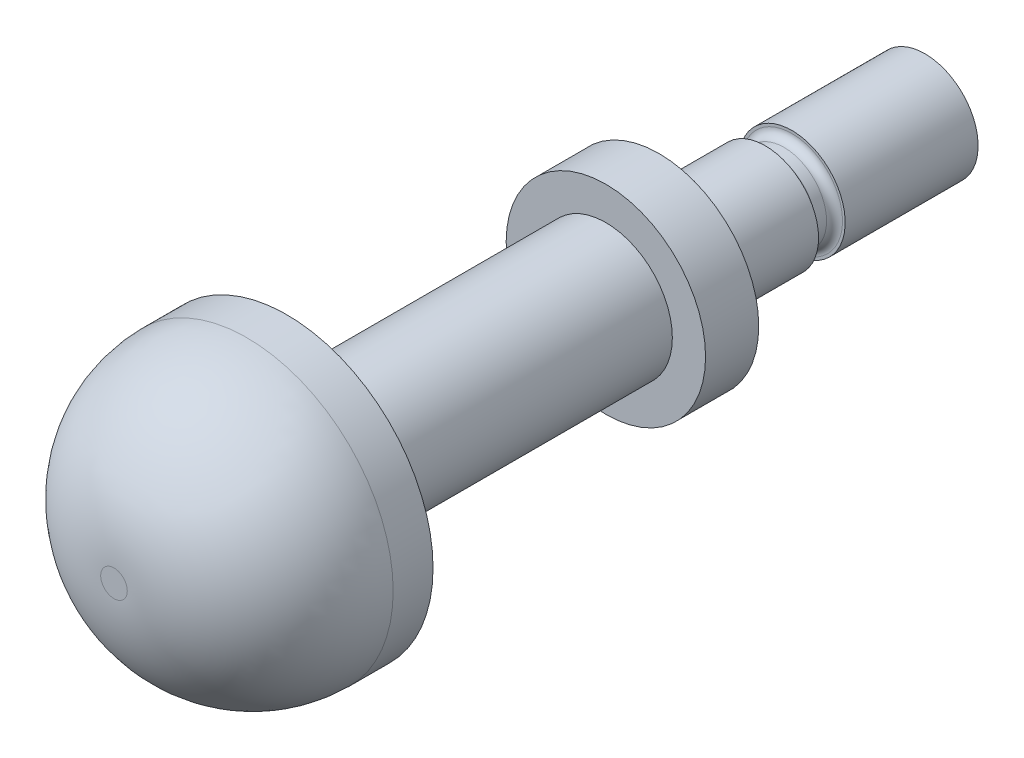
ISO-10303-21;
HEADER;
FILE_DESCRIPTION(('STEP AP214'),'2;1');
FILE_NAME('part.step','',(''),(''),'','','');
FILE_SCHEMA(('AUTOMOTIVE_DESIGN { 1 0 10303 214 1 1 1 1 }'));
ENDSEC;
DATA;
#1=APPLICATION_CONTEXT('core data for automotive mechanical design processes');
#2=APPLICATION_PROTOCOL_DEFINITION('international standard','automotive_design',2000,#1);
#3=PRODUCT_CONTEXT('',#1,'mechanical');
#4=PRODUCT('Part','Part','',(#3));
#5=PRODUCT_RELATED_PRODUCT_CATEGORY('part','',(#4));
#6=PRODUCT_DEFINITION_FORMATION('','',#4);
#7=PRODUCT_DEFINITION_CONTEXT('part definition',#1,'design');
#8=PRODUCT_DEFINITION('design','',#6,#7);
#9=PRODUCT_DEFINITION_SHAPE('','',#8);
#10=(LENGTH_UNIT() NAMED_UNIT(*) SI_UNIT(.MILLI.,.METRE.));
#11=(NAMED_UNIT(*) PLANE_ANGLE_UNIT() SI_UNIT($,.RADIAN.));
#12=(NAMED_UNIT(*) SI_UNIT($,.STERADIAN.) SOLID_ANGLE_UNIT());
#13=UNCERTAINTY_MEASURE_WITH_UNIT(LENGTH_MEASURE(1.E-05),#10,'distance_accuracy_value','');
#14=(GEOMETRIC_REPRESENTATION_CONTEXT(3) GLOBAL_UNCERTAINTY_ASSIGNED_CONTEXT((#13)) GLOBAL_UNIT_ASSIGNED_CONTEXT((#10,
#11,#12)) REPRESENTATION_CONTEXT('',''));
#15=CARTESIAN_POINT('',(0.,0.,0.));
#16=DIRECTION('',(0.,0.,1.));
#17=DIRECTION('',(1.,0.,0.));
#18=AXIS2_PLACEMENT_3D('',#15,#16,#17);
#19=CARTESIAN_POINT('',(0.,0.,4.));
#20=DIRECTION('',(0.,0.,-1.));
#21=DIRECTION('',(-1.,0.,0.));
#22=AXIS2_PLACEMENT_3D('',#19,#20,#21);
#23=CYLINDRICAL_SURFACE('',#22,2.);
#24=CARTESIAN_POINT('',(0.,0.,4.));
#25=DIRECTION('',(0.,0.,1.));
#26=DIRECTION('',(1.,0.,0.));
#27=AXIS2_PLACEMENT_3D('',#24,#25,#26);
#28=CIRCLE('',#27,2.);
#29=CARTESIAN_POINT('',(2.,0.,4.));
#30=VERTEX_POINT('',#29);
#31=EDGE_CURVE('E61',#30,#30,#28,.T.);
#32=ORIENTED_EDGE('',*,*,#31,.F.);
#33=EDGE_LOOP('',(#32));
#34=FACE_BOUND('',#33,.T.);
#35=CARTESIAN_POINT('',(0.,0.,0.));
#36=DIRECTION('',(0.,0.,1.));
#37=DIRECTION('',(1.,0.,0.));
#38=AXIS2_PLACEMENT_3D('',#35,#36,#37);
#39=CIRCLE('',#38,2.);
#40=CARTESIAN_POINT('',(2.,0.,0.));
#41=VERTEX_POINT('',#40);
#42=EDGE_CURVE('E58',#41,#41,#39,.T.);
#43=ORIENTED_EDGE('',*,*,#42,.T.);
#44=EDGE_LOOP('',(#43));
#45=FACE_BOUND('',#44,.T.);
#46=ADVANCED_FACE('F31',(#34,#45),#23,.T.);
#47=CARTESIAN_POINT('',(0.,0.,0.));
#48=DIRECTION('',(0.,0.,1.));
#49=DIRECTION('',(1.,0.,0.));
#50=AXIS2_PLACEMENT_3D('',#47,#48,#49);
#51=PLANE('',#50);
#52=CARTESIAN_POINT('',(0.,0.,0.));
#53=DIRECTION('',(0.,0.,1.));
#54=DIRECTION('',(1.,0.,0.));
#55=AXIS2_PLACEMENT_3D('',#52,#53,#54);
#56=CIRCLE('',#55,1.9);
#57=CARTESIAN_POINT('',(1.9,0.,0.));
#58=VERTEX_POINT('',#57);
#59=EDGE_CURVE('E38',#58,#58,#56,.T.);
#60=ORIENTED_EDGE('',*,*,#59,.T.);
#61=EDGE_LOOP('',(#60));
#62=FACE_BOUND('',#61,.T.);
#63=ORIENTED_EDGE('',*,*,#42,.F.);
#64=EDGE_LOOP('',(#63));
#65=FACE_BOUND('',#64,.T.);
#66=ADVANCED_FACE('F105',(#62,#65),#51,.F.);
#67=CARTESIAN_POINT('',(0.,0.,6.));
#68=DIRECTION('',(0.,0.,-1.));
#69=DIRECTION('',(-1.,0.,0.));
#70=AXIS2_PLACEMENT_3D('',#67,#68,#69);
#71=CYLINDRICAL_SURFACE('',#70,3.75);
#72=CARTESIAN_POINT('',(0.,0.,6.));
#73=DIRECTION('',(0.,0.,1.));
#74=DIRECTION('',(1.,0.,0.));
#75=AXIS2_PLACEMENT_3D('',#72,#73,#74);
#76=CIRCLE('',#75,3.75);
#77=CARTESIAN_POINT('',(3.75,0.,6.));
#78=VERTEX_POINT('',#77);
#79=EDGE_CURVE('E62',#78,#78,#76,.T.);
#80=ORIENTED_EDGE('',*,*,#79,.F.);
#81=EDGE_LOOP('',(#80));
#82=FACE_BOUND('',#81,.T.);
#83=CARTESIAN_POINT('',(0.,0.,4.));
#84=DIRECTION('',(0.,0.,1.));
#85=DIRECTION('',(1.,0.,0.));
#86=AXIS2_PLACEMENT_3D('',#83,#84,#85);
#87=CIRCLE('',#86,3.75);
#88=CARTESIAN_POINT('',(3.75,0.,4.));
#89=VERTEX_POINT('',#88);
#90=EDGE_CURVE('E65',#89,#89,#87,.T.);
#91=ORIENTED_EDGE('',*,*,#90,.T.);
#92=EDGE_LOOP('',(#91));
#93=FACE_BOUND('',#92,.T.);
#94=ADVANCED_FACE('F111',(#82,#93),#71,.T.);
#95=CARTESIAN_POINT('',(0.,0.,6.));
#96=DIRECTION('',(0.,0.,1.));
#97=DIRECTION('',(1.,0.,0.));
#98=AXIS2_PLACEMENT_3D('',#95,#96,#97);
#99=PLANE('',#98);
#100=CARTESIAN_POINT('',(0.,0.,6.));
#101=DIRECTION('',(0.,0.,1.));
#102=DIRECTION('',(1.,0.,0.));
#103=AXIS2_PLACEMENT_3D('',#100,#101,#102);
#104=CIRCLE('',#103,2.5);
#105=CARTESIAN_POINT('',(2.5,0.,6.));
#106=VERTEX_POINT('',#105);
#107=EDGE_CURVE('E57',#106,#106,#104,.T.);
#108=ORIENTED_EDGE('',*,*,#107,.F.);
#109=EDGE_LOOP('',(#108));
#110=FACE_BOUND('',#109,.T.);
#111=ORIENTED_EDGE('',*,*,#79,.T.);
#112=EDGE_LOOP('',(#111));
#113=FACE_BOUND('',#112,.T.);
#114=ADVANCED_FACE('F148',(#110,#113),#99,.T.);
#115=CARTESIAN_POINT('',(0.,0.,4.));
#116=DIRECTION('',(0.,0.,1.));
#117=DIRECTION('',(1.,0.,0.));
#118=AXIS2_PLACEMENT_3D('',#115,#116,#117);
#119=PLANE('',#118);
#120=ORIENTED_EDGE('',*,*,#31,.T.);
#121=EDGE_LOOP('',(#120));
#122=FACE_BOUND('',#121,.T.);
#123=ORIENTED_EDGE('',*,*,#90,.F.);
#124=EDGE_LOOP('',(#123));
#125=FACE_BOUND('',#124,.T.);
#126=ADVANCED_FACE('F146',(#122,#125),#119,.F.);
#127=CARTESIAN_POINT('',(0.,0.,18.));
#128=DIRECTION('',(0.,0.,-1.));
#129=DIRECTION('',(-1.,0.,0.));
#130=AXIS2_PLACEMENT_3D('',#127,#128,#129);
#131=CYLINDRICAL_SURFACE('',#130,2.5);
#132=CARTESIAN_POINT('',(0.,0.,18.));
#133=DIRECTION('',(0.,0.,1.));
#134=DIRECTION('',(1.,0.,0.));
#135=AXIS2_PLACEMENT_3D('',#132,#133,#134);
#136=CIRCLE('',#135,2.5);
#137=CARTESIAN_POINT('',(2.5,0.,18.));
#138=VERTEX_POINT('',#137);
#139=EDGE_CURVE('E68',#138,#138,#136,.T.);
#140=ORIENTED_EDGE('',*,*,#139,.F.);
#141=EDGE_LOOP('',(#140));
#142=FACE_BOUND('',#141,.T.);
#143=ORIENTED_EDGE('',*,*,#107,.T.);
#144=EDGE_LOOP('',(#143));
#145=FACE_BOUND('',#144,.T.);
#146=ADVANCED_FACE('F140',(#142,#145),#131,.T.);
#147=CARTESIAN_POINT('',(0.,0.,24.5));
#148=DIRECTION('',(0.,0.,-1.));
#149=DIRECTION('',(-1.,0.,0.));
#150=AXIS2_PLACEMENT_3D('',#147,#148,#149);
#151=CYLINDRICAL_SURFACE('',#150,5.5);
#152=CARTESIAN_POINT('',(0.,0.,19.5));
#153=DIRECTION('',(0.,0.,1.));
#154=DIRECTION('',(1.,0.,0.));
#155=AXIS2_PLACEMENT_3D('',#152,#153,#154);
#156=CIRCLE('',#155,5.5);
#157=CARTESIAN_POINT('',(5.5,0.,19.5));
#158=VERTEX_POINT('',#157);
#159=EDGE_CURVE('E51',#158,#158,#156,.F.);
#160=ORIENTED_EDGE('',*,*,#159,.T.);
#161=EDGE_LOOP('',(#160));
#162=FACE_BOUND('',#161,.T.);
#163=CARTESIAN_POINT('',(0.,0.,18.));
#164=DIRECTION('',(0.,0.,1.));
#165=DIRECTION('',(1.,0.,0.));
#166=AXIS2_PLACEMENT_3D('',#163,#164,#165);
#167=CIRCLE('',#166,5.5);
#168=CARTESIAN_POINT('',(5.5,0.,18.));
#169=VERTEX_POINT('',#168);
#170=EDGE_CURVE('E75',#169,#169,#167,.T.);
#171=ORIENTED_EDGE('',*,*,#170,.T.);
#172=EDGE_LOOP('',(#171));
#173=FACE_BOUND('',#172,.T.);
#174=ADVANCED_FACE('F135',(#162,#173),#151,.T.);
#175=CARTESIAN_POINT('',(0.,0.,24.5));
#176=DIRECTION('',(0.,0.,1.));
#177=DIRECTION('',(1.,0.,0.));
#178=AXIS2_PLACEMENT_3D('',#175,#176,#177);
#179=PLANE('',#178);
#180=CARTESIAN_POINT('',(0.,0.,24.5));
#181=DIRECTION('',(0.,0.,1.));
#182=DIRECTION('',(1.,0.,0.));
#183=AXIS2_PLACEMENT_3D('',#180,#181,#182);
#184=CIRCLE('',#183,0.5);
#185=CARTESIAN_POINT('',(0.5,0.,24.5));
#186=VERTEX_POINT('',#185);
#187=EDGE_CURVE('E54',#186,#186,#184,.T.);
#188=ORIENTED_EDGE('',*,*,#187,.T.);
#189=EDGE_LOOP('',(#188));
#190=FACE_BOUND('',#189,.T.);
#191=ADVANCED_FACE('F127',(#190),#179,.T.);
#192=CARTESIAN_POINT('',(0.,0.,18.));
#193=DIRECTION('',(0.,0.,1.));
#194=DIRECTION('',(1.,0.,0.));
#195=AXIS2_PLACEMENT_3D('',#192,#193,#194);
#196=PLANE('',#195);
#197=ORIENTED_EDGE('',*,*,#139,.T.);
#198=EDGE_LOOP('',(#197));
#199=FACE_BOUND('',#198,.T.);
#200=ORIENTED_EDGE('',*,*,#170,.F.);
#201=EDGE_LOOP('',(#200));
#202=FACE_BOUND('',#201,.T.);
#203=ADVANCED_FACE('F119',(#199,#202),#196,.F.);
#204=CARTESIAN_POINT('',(0.,0.,19.5));
#205=DIRECTION('',(0.,0.,1.));
#206=DIRECTION('',(1.,0.,0.));
#207=AXIS2_PLACEMENT_3D('',#204,#205,#206);
#208=DEGENERATE_TOROIDAL_SURFACE('',#207,0.5,5.,.T.);
#209=ORIENTED_EDGE('',*,*,#159,.F.);
#210=EDGE_LOOP('',(#209));
#211=FACE_BOUND('',#210,.T.);
#212=ORIENTED_EDGE('',*,*,#187,.F.);
#213=EDGE_LOOP('',(#212));
#214=FACE_BOUND('',#213,.T.);
#215=ADVANCED_FACE('F117',(#211,#214),#208,.T.);
#216=CARTESIAN_POINT('',(0.,0.,-1.));
#217=DIRECTION('',(0.,0.,1.));
#218=DIRECTION('',(1.,0.,0.));
#219=AXIS2_PLACEMENT_3D('',#216,#217,#218);
#220=CYLINDRICAL_SURFACE('',#219,1.6);
#221=CARTESIAN_POINT('',(0.,0.,-0.3));
#222=DIRECTION('',(0.,0.,1.));
#223=DIRECTION('',(1.,0.,0.));
#224=AXIS2_PLACEMENT_3D('',#221,#222,#223);
#225=CIRCLE('',#224,1.6);
#226=CARTESIAN_POINT('',(1.6,0.,-0.3));
#227=VERTEX_POINT('',#226);
#228=EDGE_CURVE('E42',#227,#227,#225,.F.);
#229=ORIENTED_EDGE('',*,*,#228,.T.);
#230=EDGE_LOOP('',(#229));
#231=FACE_BOUND('',#230,.T.);
#232=CARTESIAN_POINT('',(0.,0.,-0.7));
#233=DIRECTION('',(0.,0.,-1.));
#234=DIRECTION('',(-1.,0.,0.));
#235=AXIS2_PLACEMENT_3D('',#232,#233,#234);
#236=CIRCLE('',#235,1.6);
#237=CARTESIAN_POINT('',(-1.6,0.,-0.7));
#238=VERTEX_POINT('',#237);
#239=EDGE_CURVE('E46',#238,#238,#236,.F.);
#240=ORIENTED_EDGE('',*,*,#239,.T.);
#241=EDGE_LOOP('',(#240));
#242=FACE_BOUND('',#241,.T.);
#243=ADVANCED_FACE('F90',(#231,#242),#220,.T.);
#244=CARTESIAN_POINT('',(0.,0.,-6.));
#245=DIRECTION('',(0.,0.,1.));
#246=DIRECTION('',(1.,0.,0.));
#247=AXIS2_PLACEMENT_3D('',#244,#245,#246);
#248=CYLINDRICAL_SURFACE('',#247,2.);
#249=CARTESIAN_POINT('',(0.,0.,-6.));
#250=DIRECTION('',(0.,0.,-1.));
#251=DIRECTION('',(-1.,0.,0.));
#252=AXIS2_PLACEMENT_3D('',#249,#250,#251);
#253=CIRCLE('',#252,2.);
#254=CARTESIAN_POINT('',(-2.,0.,-6.));
#255=VERTEX_POINT('',#254);
#256=EDGE_CURVE('E78',#255,#255,#253,.T.);
#257=ORIENTED_EDGE('',*,*,#256,.F.);
#258=EDGE_LOOP('',(#257));
#259=FACE_BOUND('',#258,.T.);
#260=CARTESIAN_POINT('',(0.,0.,-1.));
#261=DIRECTION('',(0.,0.,-1.));
#262=DIRECTION('',(-1.,0.,0.));
#263=AXIS2_PLACEMENT_3D('',#260,#261,#262);
#264=CIRCLE('',#263,2.);
#265=CARTESIAN_POINT('',(-2.,0.,-1.));
#266=VERTEX_POINT('',#265);
#267=EDGE_CURVE('E79',#266,#266,#264,.T.);
#268=ORIENTED_EDGE('',*,*,#267,.T.);
#269=EDGE_LOOP('',(#268));
#270=FACE_BOUND('',#269,.T.);
#271=ADVANCED_FACE('F87',(#259,#270),#248,.T.);
#272=CARTESIAN_POINT('',(0.,0.,-6.));
#273=DIRECTION('',(0.,0.,-1.));
#274=DIRECTION('',(-1.,0.,0.));
#275=AXIS2_PLACEMENT_3D('',#272,#273,#274);
#276=PLANE('',#275);
#277=ORIENTED_EDGE('',*,*,#256,.T.);
#278=EDGE_LOOP('',(#277));
#279=FACE_BOUND('',#278,.T.);
#280=ADVANCED_FACE('F85',(#279),#276,.T.);
#281=CARTESIAN_POINT('',(0.,0.,-1.));
#282=DIRECTION('',(0.,0.,-1.));
#283=DIRECTION('',(-1.,0.,0.));
#284=AXIS2_PLACEMENT_3D('',#281,#282,#283);
#285=PLANE('',#284);
#286=CARTESIAN_POINT('',(0.,0.,-1.));
#287=DIRECTION('',(0.,0.,-1.));
#288=DIRECTION('',(-1.,0.,0.));
#289=AXIS2_PLACEMENT_3D('',#286,#287,#288);
#290=CIRCLE('',#289,1.9);
#291=CARTESIAN_POINT('',(-1.9,0.,-1.));
#292=VERTEX_POINT('',#291);
#293=EDGE_CURVE('E10',#292,#292,#290,.T.);
#294=ORIENTED_EDGE('',*,*,#293,.T.);
#295=EDGE_LOOP('',(#294));
#296=FACE_BOUND('',#295,.T.);
#297=ORIENTED_EDGE('',*,*,#267,.F.);
#298=EDGE_LOOP('',(#297));
#299=FACE_BOUND('',#298,.T.);
#300=ADVANCED_FACE('F94',(#296,#299),#285,.F.);
#301=CARTESIAN_POINT('',(0.,0.,-0.3));
#302=DIRECTION('',(0.,0.,1.));
#303=DIRECTION('',(1.,0.,0.));
#304=AXIS2_PLACEMENT_3D('',#301,#302,#303);
#305=TOROIDAL_SURFACE('',#304,1.9,0.3);
#306=ORIENTED_EDGE('',*,*,#59,.F.);
#307=EDGE_LOOP('',(#306));
#308=FACE_BOUND('',#307,.T.);
#309=ORIENTED_EDGE('',*,*,#228,.F.);
#310=EDGE_LOOP('',(#309));
#311=FACE_BOUND('',#310,.T.);
#312=ADVANCED_FACE('F96',(#308,#311),#305,.F.);
#313=CARTESIAN_POINT('',(0.,0.,-0.7));
#314=DIRECTION('',(0.,0.,-1.));
#315=DIRECTION('',(-1.,0.,0.));
#316=AXIS2_PLACEMENT_3D('',#313,#314,#315);
#317=TOROIDAL_SURFACE('',#316,1.9,0.3);
#318=ORIENTED_EDGE('',*,*,#239,.F.);
#319=EDGE_LOOP('',(#318));
#320=FACE_BOUND('',#319,.T.);
#321=ORIENTED_EDGE('',*,*,#293,.F.);
#322=EDGE_LOOP('',(#321));
#323=FACE_BOUND('',#322,.T.);
#324=ADVANCED_FACE('F33',(#320,#323),#317,.F.);
#325=CLOSED_SHELL('',(#46,#66,#94,#114,#126,#146,#174,#191,#203,#215,#243,#271,#280,#300,#312,#324));
#326=MANIFOLD_SOLID_BREP('B2',#325);
#327=ADVANCED_BREP_SHAPE_REPRESENTATION('',(#18,#326),#14);
#328=SHAPE_DEFINITION_REPRESENTATION(#9,#327);
ENDSEC;
END-ISO-10303-21;
